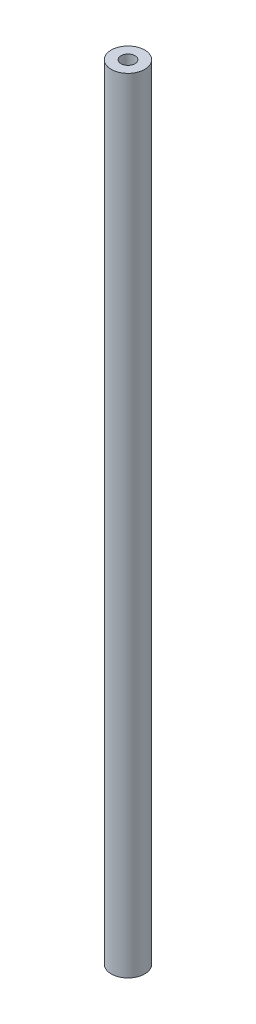
ISO-10303-21;
HEADER;
FILE_DESCRIPTION(('STEP AP214'),'2;1');
FILE_NAME('part.step','',(''),(''),'','','');
FILE_SCHEMA(('AUTOMOTIVE_DESIGN { 1 0 10303 214 1 1 1 1 }'));
ENDSEC;
DATA;
#1=APPLICATION_CONTEXT('core data for automotive mechanical design processes');
#2=APPLICATION_PROTOCOL_DEFINITION('international standard','automotive_design',2000,#1);
#3=PRODUCT_CONTEXT('',#1,'mechanical');
#4=PRODUCT('Part','Part','',(#3));
#5=PRODUCT_RELATED_PRODUCT_CATEGORY('part','',(#4));
#6=PRODUCT_DEFINITION_FORMATION('','',#4);
#7=PRODUCT_DEFINITION_CONTEXT('part definition',#1,'design');
#8=PRODUCT_DEFINITION('design','',#6,#7);
#9=PRODUCT_DEFINITION_SHAPE('','',#8);
#10=(LENGTH_UNIT() NAMED_UNIT(*) SI_UNIT(.MILLI.,.METRE.));
#11=(NAMED_UNIT(*) PLANE_ANGLE_UNIT() SI_UNIT($,.RADIAN.));
#12=(NAMED_UNIT(*) SI_UNIT($,.STERADIAN.) SOLID_ANGLE_UNIT());
#13=UNCERTAINTY_MEASURE_WITH_UNIT(LENGTH_MEASURE(1.E-05),#10,'distance_accuracy_value','');
#14=(GEOMETRIC_REPRESENTATION_CONTEXT(3) GLOBAL_UNCERTAINTY_ASSIGNED_CONTEXT((#13)) GLOBAL_UNIT_ASSIGNED_CONTEXT((#10,
#11,#12)) REPRESENTATION_CONTEXT('',''));
#15=CARTESIAN_POINT('',(0.,0.,0.));
#16=DIRECTION('',(0.,0.,1.));
#17=DIRECTION('',(1.,0.,0.));
#18=AXIS2_PLACEMENT_3D('',#15,#16,#17);
#19=CARTESIAN_POINT('',(0.,93.5,0.));
#20=DIRECTION('',(0.,1.,0.));
#21=DIRECTION('',(1.,0.,0.));
#22=AXIS2_PLACEMENT_3D('',#19,#20,#21);
#23=PLANE('',#22);
#24=CARTESIAN_POINT('',(0.,93.5,0.));
#25=DIRECTION('',(0.,-1.,0.));
#26=DIRECTION('',(1.,0.,0.));
#27=AXIS2_PLACEMENT_3D('',#24,#25,#26);
#28=CIRCLE('',#27,1.666);
#29=CARTESIAN_POINT('',(-1.666,93.5,0.));
#30=VERTEX_POINT('',#29);
#31=EDGE_CURVE('E74',#30,#30,#28,.T.);
#32=ORIENTED_EDGE('',*,*,#31,.T.);
#33=EDGE_LOOP('',(#32));
#34=FACE_BOUND('',#33,.T.);
#35=CARTESIAN_POINT('',(0.,93.5,0.));
#36=DIRECTION('',(0.,1.,0.));
#37=DIRECTION('',(1.,0.,0.));
#38=AXIS2_PLACEMENT_3D('',#35,#36,#37);
#39=CIRCLE('',#38,4.);
#40=CARTESIAN_POINT('',(-4.,93.5,0.));
#41=VERTEX_POINT('',#40);
#42=EDGE_CURVE('E27',#41,#41,#39,.T.);
#43=ORIENTED_EDGE('',*,*,#42,.T.);
#44=EDGE_LOOP('',(#43));
#45=FACE_BOUND('',#44,.T.);
#46=ADVANCED_FACE('F16',(#34,#45),#23,.T.);
#47=CARTESIAN_POINT('',(0.,0.,0.));
#48=DIRECTION('',(0.,1.,0.));
#49=DIRECTION('',(1.,0.,0.));
#50=AXIS2_PLACEMENT_3D('',#47,#48,#49);
#51=CYLINDRICAL_SURFACE('',#50,4.);
#52=ORIENTED_EDGE('',*,*,#42,.F.);
#53=DIRECTION('',(0.,-1.,0.));
#54=VECTOR('',#53,1.);
#55=CARTESIAN_POINT('',(-4.,0.,0.));
#56=LINE('',#55,#54);
#57=CARTESIAN_POINT('',(-4.,-93.5,0.));
#58=VERTEX_POINT('',#57);
#59=EDGE_CURVE('E11',#41,#58,#56,.T.);
#60=ORIENTED_EDGE('',*,*,#59,.T.);
#61=CARTESIAN_POINT('',(0.,-93.5,0.));
#62=DIRECTION('',(0.,-1.,0.));
#63=DIRECTION('',(1.,0.,0.));
#64=AXIS2_PLACEMENT_3D('',#61,#62,#63);
#65=CIRCLE('',#64,4.);
#66=EDGE_CURVE('E87',#58,#58,#65,.T.);
#67=ORIENTED_EDGE('',*,*,#66,.F.);
#68=ORIENTED_EDGE('',*,*,#59,.F.);
#69=EDGE_LOOP('',(#52,#60,#67,#68));
#70=FACE_BOUND('',#69,.T.);
#71=ADVANCED_FACE('F115',(#70),#51,.T.);
#72=CARTESIAN_POINT('',(0.,-93.5,0.));
#73=DIRECTION('',(0.,1.,0.));
#74=DIRECTION('',(1.,0.,0.));
#75=AXIS2_PLACEMENT_3D('',#72,#73,#74);
#76=PLANE('',#75);
#77=CARTESIAN_POINT('',(0.,-93.5,0.));
#78=DIRECTION('',(0.,1.,0.));
#79=DIRECTION('',(1.,0.,0.));
#80=AXIS2_PLACEMENT_3D('',#77,#78,#79);
#81=CIRCLE('',#80,1.666);
#82=CARTESIAN_POINT('',(-1.666,-93.5,0.));
#83=VERTEX_POINT('',#82);
#84=EDGE_CURVE('E90',#83,#83,#81,.T.);
#85=ORIENTED_EDGE('',*,*,#84,.T.);
#86=EDGE_LOOP('',(#85));
#87=FACE_BOUND('',#86,.T.);
#88=ORIENTED_EDGE('',*,*,#66,.T.);
#89=EDGE_LOOP('',(#88));
#90=FACE_BOUND('',#89,.T.);
#91=ADVANCED_FACE('F18',(#87,#90),#76,.F.);
#92=CARTESIAN_POINT('',(0.,-84.5,0.));
#93=DIRECTION('',(0.,-1.,0.));
#94=DIRECTION('',(0.,0.,-1.));
#95=AXIS2_PLACEMENT_3D('',#92,#93,#94);
#96=PLANE('',#95);
#97=CARTESIAN_POINT('',(0.,-84.5,0.));
#98=DIRECTION('',(0.,1.,0.));
#99=DIRECTION('',(1.,0.,0.));
#100=AXIS2_PLACEMENT_3D('',#97,#98,#99);
#101=CIRCLE('',#100,1.666);
#102=CARTESIAN_POINT('',(-1.666,-84.5,0.));
#103=VERTEX_POINT('',#102);
#104=EDGE_CURVE('E53',#103,#103,#101,.T.);
#105=ORIENTED_EDGE('',*,*,#104,.F.);
#106=EDGE_LOOP('',(#105));
#107=FACE_BOUND('',#106,.T.);
#108=ADVANCED_FACE('F127',(#107),#96,.T.);
#109=CARTESIAN_POINT('',(0.,-93.5,0.));
#110=DIRECTION('',(0.,1.,0.));
#111=DIRECTION('',(1.,0.,0.));
#112=AXIS2_PLACEMENT_3D('',#109,#110,#111);
#113=CYLINDRICAL_SURFACE('',#112,1.666);
#114=ORIENTED_EDGE('',*,*,#84,.F.);
#115=DIRECTION('',(0.,1.,0.));
#116=VECTOR('',#115,1.);
#117=CARTESIAN_POINT('',(-1.666,-93.5,0.));
#118=LINE('',#117,#116);
#119=EDGE_CURVE('E58',#83,#103,#118,.T.);
#120=ORIENTED_EDGE('',*,*,#119,.T.);
#121=ORIENTED_EDGE('',*,*,#104,.T.);
#122=ORIENTED_EDGE('',*,*,#119,.F.);
#123=EDGE_LOOP('',(#114,#120,#121,#122));
#124=FACE_BOUND('',#123,.T.);
#125=ADVANCED_FACE('F132',(#124),#113,.F.);
#126=CARTESIAN_POINT('',(0.,84.5,0.));
#127=DIRECTION('',(0.,1.,0.));
#128=DIRECTION('',(1.,0.,0.));
#129=AXIS2_PLACEMENT_3D('',#126,#127,#128);
#130=PLANE('',#129);
#131=CARTESIAN_POINT('',(0.,84.5,0.));
#132=DIRECTION('',(0.,-1.,0.));
#133=DIRECTION('',(1.,0.,0.));
#134=AXIS2_PLACEMENT_3D('',#131,#132,#133);
#135=CIRCLE('',#134,1.666);
#136=CARTESIAN_POINT('',(-1.666,84.5,0.));
#137=VERTEX_POINT('',#136);
#138=EDGE_CURVE('E69',#137,#137,#135,.T.);
#139=ORIENTED_EDGE('',*,*,#138,.F.);
#140=EDGE_LOOP('',(#139));
#141=FACE_BOUND('',#140,.T.);
#142=ADVANCED_FACE('F138',(#141),#130,.T.);
#143=CARTESIAN_POINT('',(0.,93.5,0.));
#144=DIRECTION('',(0.,-1.,0.));
#145=DIRECTION('',(1.,0.,0.));
#146=AXIS2_PLACEMENT_3D('',#143,#144,#145);
#147=CYLINDRICAL_SURFACE('',#146,1.666);
#148=ORIENTED_EDGE('',*,*,#31,.F.);
#149=DIRECTION('',(0.,-1.,0.));
#150=VECTOR('',#149,1.);
#151=CARTESIAN_POINT('',(-1.666,93.5,0.));
#152=LINE('',#151,#150);
#153=EDGE_CURVE('E20',#30,#137,#152,.T.);
#154=ORIENTED_EDGE('',*,*,#153,.T.);
#155=ORIENTED_EDGE('',*,*,#138,.T.);
#156=ORIENTED_EDGE('',*,*,#153,.F.);
#157=EDGE_LOOP('',(#148,#154,#155,#156));
#158=FACE_BOUND('',#157,.T.);
#159=ADVANCED_FACE('F73',(#158),#147,.F.);
#160=CLOSED_SHELL('',(#46,#71,#91,#108,#125,#142,#159));
#161=MANIFOLD_SOLID_BREP('B1',#160);
#162=ADVANCED_BREP_SHAPE_REPRESENTATION('',(#18,#161),#14);
#163=SHAPE_DEFINITION_REPRESENTATION(#9,#162);
ENDSEC;
END-ISO-10303-21;
